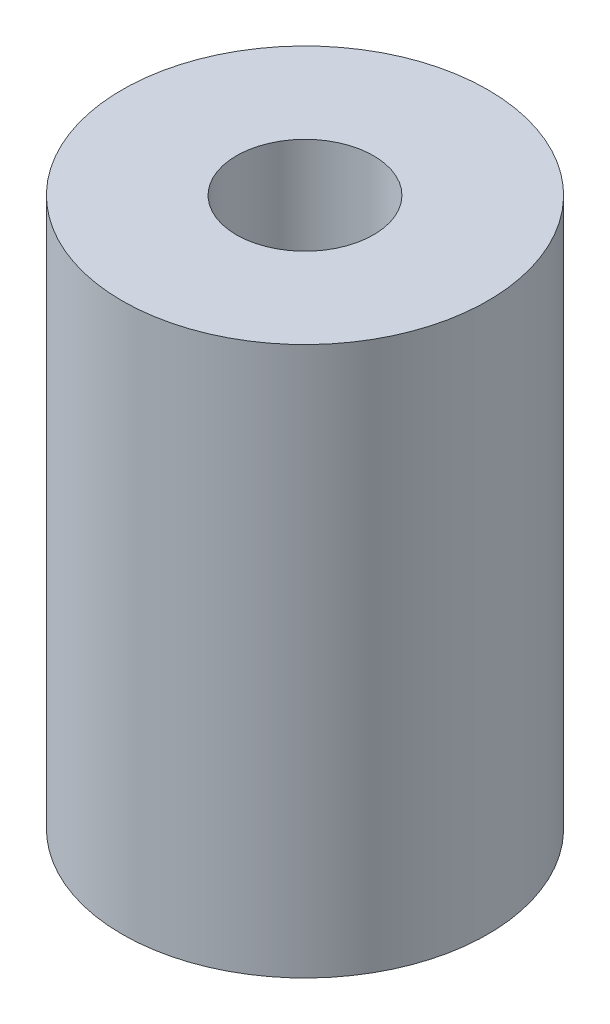
ISO-10303-21;
HEADER;
FILE_DESCRIPTION(('STEP AP214'),'2;1');
FILE_NAME('part.step','',(''),(''),'','','');
FILE_SCHEMA(('AUTOMOTIVE_DESIGN { 1 0 10303 214 1 1 1 1 }'));
ENDSEC;
DATA;
#1=APPLICATION_CONTEXT('core data for automotive mechanical design processes');
#2=APPLICATION_PROTOCOL_DEFINITION('international standard','automotive_design',2000,#1);
#3=PRODUCT_CONTEXT('',#1,'mechanical');
#4=PRODUCT('Part','Part','',(#3));
#5=PRODUCT_RELATED_PRODUCT_CATEGORY('part','',(#4));
#6=PRODUCT_DEFINITION_FORMATION('','',#4);
#7=PRODUCT_DEFINITION_CONTEXT('part definition',#1,'design');
#8=PRODUCT_DEFINITION('design','',#6,#7);
#9=PRODUCT_DEFINITION_SHAPE('','',#8);
#10=(LENGTH_UNIT() NAMED_UNIT(*) SI_UNIT(.MILLI.,.METRE.));
#11=(NAMED_UNIT(*) PLANE_ANGLE_UNIT() SI_UNIT($,.RADIAN.));
#12=(NAMED_UNIT(*) SI_UNIT($,.STERADIAN.) SOLID_ANGLE_UNIT());
#13=UNCERTAINTY_MEASURE_WITH_UNIT(LENGTH_MEASURE(1.E-05),#10,'distance_accuracy_value','');
#14=(GEOMETRIC_REPRESENTATION_CONTEXT(3) GLOBAL_UNCERTAINTY_ASSIGNED_CONTEXT((#13)) GLOBAL_UNIT_ASSIGNED_CONTEXT((#10,
#11,#12)) REPRESENTATION_CONTEXT('',''));
#15=CARTESIAN_POINT('',(0.,0.,0.));
#16=DIRECTION('',(0.,0.,1.));
#17=DIRECTION('',(1.,0.,0.));
#18=AXIS2_PLACEMENT_3D('',#15,#16,#17);
#19=CARTESIAN_POINT('',(0.,12.,0.));
#20=DIRECTION('',(0.,1.,0.));
#21=DIRECTION('',(0.,0.,1.));
#22=AXIS2_PLACEMENT_3D('',#19,#20,#21);
#23=PLANE('',#22);
#24=CARTESIAN_POINT('',(0.,12.,0.));
#25=DIRECTION('',(0.,1.,0.));
#26=DIRECTION('',(0.,0.,1.));
#27=AXIS2_PLACEMENT_3D('',#24,#25,#26);
#28=CIRCLE('',#27,4.);
#29=CARTESIAN_POINT('',(0.,12.,4.));
#30=VERTEX_POINT('',#29);
#31=EDGE_CURVE('E10',#30,#30,#28,.T.);
#32=ORIENTED_EDGE('',*,*,#31,.T.);
#33=EDGE_LOOP('',(#32));
#34=FACE_BOUND('',#33,.T.);
#35=CARTESIAN_POINT('',(0.,12.,0.));
#36=DIRECTION('',(0.,1.,0.));
#37=DIRECTION('',(0.,0.,1.));
#38=AXIS2_PLACEMENT_3D('',#35,#36,#37);
#39=CIRCLE('',#38,1.5);
#40=CARTESIAN_POINT('',(0.,12.,1.5));
#41=VERTEX_POINT('',#40);
#42=EDGE_CURVE('E45',#41,#41,#39,.T.);
#43=ORIENTED_EDGE('',*,*,#42,.F.);
#44=EDGE_LOOP('',(#43));
#45=FACE_BOUND('',#44,.T.);
#46=ADVANCED_FACE('F34',(#34,#45),#23,.T.);
#47=CARTESIAN_POINT('',(0.,0.,0.));
#48=DIRECTION('',(0.,1.,0.));
#49=DIRECTION('',(0.,0.,1.));
#50=AXIS2_PLACEMENT_3D('',#47,#48,#49);
#51=PLANE('',#50);
#52=CARTESIAN_POINT('',(0.,0.,0.));
#53=DIRECTION('',(0.,1.,0.));
#54=DIRECTION('',(0.,0.,1.));
#55=AXIS2_PLACEMENT_3D('',#52,#53,#54);
#56=CIRCLE('',#55,4.);
#57=CARTESIAN_POINT('',(0.,0.,4.));
#58=VERTEX_POINT('',#57);
#59=EDGE_CURVE('E38',#58,#58,#56,.T.);
#60=ORIENTED_EDGE('',*,*,#59,.F.);
#61=EDGE_LOOP('',(#60));
#62=FACE_BOUND('',#61,.T.);
#63=CARTESIAN_POINT('',(0.,0.,0.));
#64=DIRECTION('',(0.,1.,0.));
#65=DIRECTION('',(0.,0.,1.));
#66=AXIS2_PLACEMENT_3D('',#63,#64,#65);
#67=CIRCLE('',#66,1.5);
#68=CARTESIAN_POINT('',(0.,0.,1.5));
#69=VERTEX_POINT('',#68);
#70=EDGE_CURVE('E47',#69,#69,#67,.T.);
#71=ORIENTED_EDGE('',*,*,#70,.T.);
#72=EDGE_LOOP('',(#71));
#73=FACE_BOUND('',#72,.T.);
#74=ADVANCED_FACE('F57',(#62,#73),#51,.F.);
#75=CARTESIAN_POINT('',(0.,12.,0.));
#76=DIRECTION('',(0.,-1.,0.));
#77=DIRECTION('',(0.,0.,-1.));
#78=AXIS2_PLACEMENT_3D('',#75,#76,#77);
#79=CYLINDRICAL_SURFACE('',#78,4.);
#80=ORIENTED_EDGE('',*,*,#31,.F.);
#81=EDGE_LOOP('',(#80));
#82=FACE_BOUND('',#81,.T.);
#83=ORIENTED_EDGE('',*,*,#59,.T.);
#84=EDGE_LOOP('',(#83));
#85=FACE_BOUND('',#84,.T.);
#86=ADVANCED_FACE('F36',(#82,#85),#79,.T.);
#87=CARTESIAN_POINT('',(0.,12.,0.));
#88=DIRECTION('',(0.,-1.,0.));
#89=DIRECTION('',(0.,0.,-1.));
#90=AXIS2_PLACEMENT_3D('',#87,#88,#89);
#91=CYLINDRICAL_SURFACE('',#90,1.5);
#92=ORIENTED_EDGE('',*,*,#42,.T.);
#93=EDGE_LOOP('',(#92));
#94=FACE_BOUND('',#93,.T.);
#95=ORIENTED_EDGE('',*,*,#70,.F.);
#96=EDGE_LOOP('',(#95));
#97=FACE_BOUND('',#96,.T.);
#98=ADVANCED_FACE('F53',(#94,#97),#91,.F.);
#99=CLOSED_SHELL('',(#46,#74,#86,#98));
#100=MANIFOLD_SOLID_BREP('B2',#99);
#101=ADVANCED_BREP_SHAPE_REPRESENTATION('',(#18,#100),#14);
#102=SHAPE_DEFINITION_REPRESENTATION(#9,#101);
ENDSEC;
END-ISO-10303-21;
